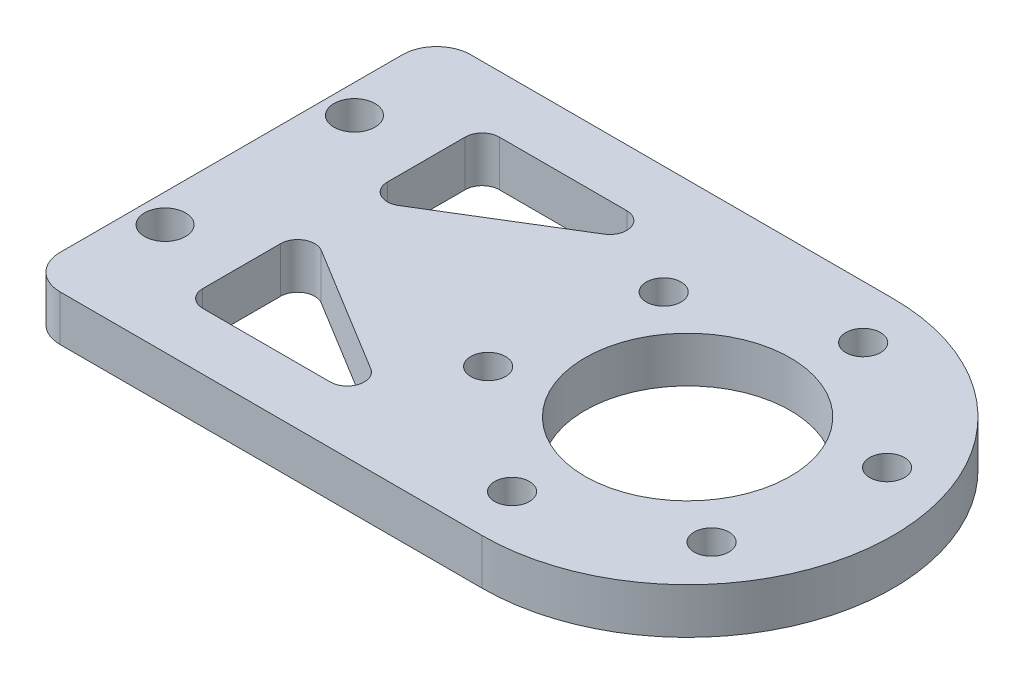
ISO-10303-21;
HEADER;
FILE_DESCRIPTION(('STEP AP214'),'2;1');
FILE_NAME('part.step','',(''),(''),'','','');
FILE_SCHEMA(('AUTOMOTIVE_DESIGN { 1 0 10303 214 1 1 1 1 }'));
ENDSEC;
DATA;
#1=APPLICATION_CONTEXT('core data for automotive mechanical design processes');
#2=APPLICATION_PROTOCOL_DEFINITION('international standard','automotive_design',2000,#1);
#3=PRODUCT_CONTEXT('',#1,'mechanical');
#4=PRODUCT('Part','Part','',(#3));
#5=PRODUCT_RELATED_PRODUCT_CATEGORY('part','',(#4));
#6=PRODUCT_DEFINITION_FORMATION('','',#4);
#7=PRODUCT_DEFINITION_CONTEXT('part definition',#1,'design');
#8=PRODUCT_DEFINITION('design','',#6,#7);
#9=PRODUCT_DEFINITION_SHAPE('','',#8);
#10=(LENGTH_UNIT() NAMED_UNIT(*) SI_UNIT(.MILLI.,.METRE.));
#11=(NAMED_UNIT(*) PLANE_ANGLE_UNIT() SI_UNIT($,.RADIAN.));
#12=(NAMED_UNIT(*) SI_UNIT($,.STERADIAN.) SOLID_ANGLE_UNIT());
#13=UNCERTAINTY_MEASURE_WITH_UNIT(LENGTH_MEASURE(1.E-05),#10,'distance_accuracy_value','');
#14=(GEOMETRIC_REPRESENTATION_CONTEXT(3) GLOBAL_UNCERTAINTY_ASSIGNED_CONTEXT((#13)) GLOBAL_UNIT_ASSIGNED_CONTEXT((#10,
#11,#12)) REPRESENTATION_CONTEXT('',''));
#15=CARTESIAN_POINT('',(0.,0.,0.));
#16=DIRECTION('',(0.,0.,1.));
#17=DIRECTION('',(1.,0.,0.));
#18=AXIS2_PLACEMENT_3D('',#15,#16,#17);
#19=CARTESIAN_POINT('',(0.,4.,0.));
#20=DIRECTION('',(0.,1.,0.));
#21=DIRECTION('',(0.,0.,1.));
#22=AXIS2_PLACEMENT_3D('',#19,#20,#21);
#23=PLANE('',#22);
#24=CARTESIAN_POINT('',(20.,4.,0.));
#25=DIRECTION('',(0.,1.,0.));
#26=DIRECTION('',(0.,0.,1.));
#27=AXIS2_PLACEMENT_3D('',#24,#25,#26);
#28=CIRCLE('',#27,9.);
#29=CARTESIAN_POINT('',(20.,4.,9.));
#30=VERTEX_POINT('',#29);
#31=EDGE_CURVE('E647',#30,#30,#28,.T.);
#32=ORIENTED_EDGE('',*,*,#31,.F.);
#33=EDGE_LOOP('',(#32));
#34=FACE_BOUND('',#33,.T.);
#35=DIRECTION('',(0.,0.,1.));
#36=VECTOR('',#35,1.);
#37=CARTESIAN_POINT('',(-11.,4.,0.));
#38=LINE('',#37,#36);
#39=CARTESIAN_POINT('',(-11.,4.,4.67458525914408));
#40=VERTEX_POINT('',#39);
#41=CARTESIAN_POINT('',(-11.,4.,11.5));
#42=VERTEX_POINT('',#41);
#43=EDGE_CURVE('E264',#40,#42,#38,.T.);
#44=ORIENTED_EDGE('',*,*,#43,.F.);
#45=CARTESIAN_POINT('',(-9.50000000000001,4.,4.67458525914408));
#46=DIRECTION('',(0.,1.,0.));
#47=DIRECTION('',(0.,0.,1.));
#48=AXIS2_PLACEMENT_3D('',#45,#46,#47);
#49=CIRCLE('',#48,1.5);
#50=CARTESIAN_POINT('',(-8.71782498581905,4.,3.39466250866614));
#51=VERTEX_POINT('',#50);
#52=EDGE_CURVE('E258',#40,#51,#49,.F.);
#53=ORIENTED_EDGE('',*,*,#52,.T.);
#54=DIRECTION('',(0.853281833651959,0.,0.521450009453975));
#55=VECTOR('',#54,1.);
#56=CARTESIAN_POINT('',(-3.8808988764045,4.,6.35056179775281));
#57=LINE('',#56,#55);
#58=CARTESIAN_POINT('',(2.45103549921791,4.,10.2200772495221));
#59=VERTEX_POINT('',#58);
#60=EDGE_CURVE('E289',#51,#59,#57,.T.);
#61=ORIENTED_EDGE('',*,*,#60,.T.);
#62=CARTESIAN_POINT('',(1.66886048503695,4.,11.5));
#63=DIRECTION('',(0.,1.,0.));
#64=DIRECTION('',(0.,0.,1.));
#65=AXIS2_PLACEMENT_3D('',#62,#63,#64);
#66=CIRCLE('',#65,1.5);
#67=CARTESIAN_POINT('',(1.66886048503695,4.,13.));
#68=VERTEX_POINT('',#67);
#69=EDGE_CURVE('E254',#59,#68,#66,.F.);
#70=ORIENTED_EDGE('',*,*,#69,.T.);
#71=DIRECTION('',(1.,0.,0.));
#72=VECTOR('',#71,1.);
#73=CARTESIAN_POINT('',(0.,4.,13.));
#74=LINE('',#73,#72);
#75=CARTESIAN_POINT('',(-9.50000000000001,4.,13.));
#76=VERTEX_POINT('',#75);
#77=EDGE_CURVE('E266',#76,#68,#74,.T.);
#78=ORIENTED_EDGE('',*,*,#77,.F.);
#79=CARTESIAN_POINT('',(-9.50000000000001,4.,11.5));
#80=DIRECTION('',(0.,1.,0.));
#81=DIRECTION('',(0.,0.,1.));
#82=AXIS2_PLACEMENT_3D('',#79,#80,#81);
#83=CIRCLE('',#82,1.5);
#84=EDGE_CURVE('E46',#76,#42,#83,.F.);
#85=ORIENTED_EDGE('',*,*,#84,.T.);
#86=EDGE_LOOP('',(#44,#53,#61,#70,#78,#85));
#87=FACE_BOUND('',#86,.T.);
#88=CARTESIAN_POINT('',(-17.5000000000019,4.,8.30000000000051));
#89=DIRECTION('',(0.,1.,0.));
#90=DIRECTION('',(0.,0.,1.));
#91=AXIS2_PLACEMENT_3D('',#88,#89,#90);
#92=CIRCLE('',#91,1.80000000000241);
#93=CARTESIAN_POINT('',(-17.5000000000019,4.,10.1000000000029));
#94=VERTEX_POINT('',#93);
#95=EDGE_CURVE('E318',#94,#94,#92,.T.);
#96=ORIENTED_EDGE('',*,*,#95,.F.);
#97=EDGE_LOOP('',(#96));
#98=FACE_BOUND('',#97,.T.);
#99=CARTESIAN_POINT('',(-17.5000000000019,4.,-8.29999999999949));
#100=DIRECTION('',(0.,1.,0.));
#101=DIRECTION('',(0.,0.,1.));
#102=AXIS2_PLACEMENT_3D('',#99,#100,#101);
#103=CIRCLE('',#102,1.80000000000241);
#104=CARTESIAN_POINT('',(-17.5000000000019,4.,-6.49999999999708));
#105=VERTEX_POINT('',#104);
#106=EDGE_CURVE('E306',#105,#105,#103,.T.);
#107=ORIENTED_EDGE('',*,*,#106,.F.);
#108=EDGE_LOOP('',(#107));
#109=FACE_BOUND('',#108,.T.);
#110=CARTESIAN_POINT('',(22.0405474756566,4.,-13.3448928807837));
#111=DIRECTION('',(0.,1.,0.));
#112=DIRECTION('',(0.,0.,1.));
#113=AXIS2_PLACEMENT_3D('',#110,#111,#112);
#114=CIRCLE('',#113,1.525);
#115=CARTESIAN_POINT('',(22.0405474756566,4.,-11.8198928807837));
#116=VERTEX_POINT('',#115);
#117=EDGE_CURVE('E317',#116,#116,#114,.T.);
#118=ORIENTED_EDGE('',*,*,#117,.F.);
#119=EDGE_LOOP('',(#118));
#120=FACE_BOUND('',#119,.T.);
#121=CARTESIAN_POINT('',(7.42271001663097,4.,4.90528048884506));
#122=DIRECTION('',(0.,1.,0.));
#123=DIRECTION('',(0.,0.,1.));
#124=AXIS2_PLACEMENT_3D('',#121,#122,#123);
#125=CIRCLE('',#124,1.525);
#126=CARTESIAN_POINT('',(7.42271001663097,4.,6.43028048884506));
#127=VERTEX_POINT('',#126);
#128=EDGE_CURVE('E344',#127,#127,#125,.T.);
#129=ORIENTED_EDGE('',*,*,#128,.F.);
#130=EDGE_LOOP('',(#129));
#131=FACE_BOUND('',#130,.T.);
#132=CARTESIAN_POINT('',(30.5367425077125,4.,8.43961239193871));
#133=DIRECTION('',(0.,1.,0.));
#134=DIRECTION('',(0.,0.,1.));
#135=AXIS2_PLACEMENT_3D('',#132,#133,#134);
#136=CIRCLE('',#135,1.525);
#137=CARTESIAN_POINT('',(30.5367425077125,4.,9.96461239193871));
#138=VERTEX_POINT('',#137);
#139=EDGE_CURVE('E329',#138,#138,#136,.T.);
#140=ORIENTED_EDGE('',*,*,#139,.F.);
#141=EDGE_LOOP('',(#140));
#142=FACE_BOUND('',#141,.T.);
#143=CARTESIAN_POINT('',(17.9594525243435,4.,13.3448928807837));
#144=DIRECTION('',(0.,1.,0.));
#145=DIRECTION('',(0.,0.,1.));
#146=AXIS2_PLACEMENT_3D('',#143,#144,#145);
#147=CIRCLE('',#146,1.525);
#148=CARTESIAN_POINT('',(17.9594525243435,4.,14.8698928807837));
#149=VERTEX_POINT('',#148);
#150=EDGE_CURVE('E330',#149,#149,#147,.T.);
#151=ORIENTED_EDGE('',*,*,#150,.F.);
#152=EDGE_LOOP('',(#151));
#153=FACE_BOUND('',#152,.T.);
#154=CARTESIAN_POINT('',(32.5772899833691,4.,-4.90528048884498));
#155=DIRECTION('',(0.,1.,0.));
#156=DIRECTION('',(0.,0.,1.));
#157=AXIS2_PLACEMENT_3D('',#154,#155,#156);
#158=CIRCLE('',#157,1.525);
#159=CARTESIAN_POINT('',(32.5772899833691,4.,-3.38028048884499));
#160=VERTEX_POINT('',#159);
#161=EDGE_CURVE('E336',#160,#160,#158,.T.);
#162=ORIENTED_EDGE('',*,*,#161,.F.);
#163=EDGE_LOOP('',(#162));
#164=FACE_BOUND('',#163,.T.);
#165=CARTESIAN_POINT('',(9.46325749228757,4.,-8.43961239193863));
#166=DIRECTION('',(0.,1.,0.));
#167=DIRECTION('',(0.,0.,1.));
#168=AXIS2_PLACEMENT_3D('',#165,#166,#167);
#169=CIRCLE('',#168,1.525);
#170=CARTESIAN_POINT('',(9.46325749228757,4.,-6.91461239193864));
#171=VERTEX_POINT('',#170);
#172=EDGE_CURVE('E343',#171,#171,#169,.T.);
#173=ORIENTED_EDGE('',*,*,#172,.F.);
#174=EDGE_LOOP('',(#173));
#175=FACE_BOUND('',#174,.T.);
#176=DIRECTION('',(1.,0.,0.));
#177=VECTOR('',#176,1.);
#178=CARTESIAN_POINT('',(0.,4.,-18.));
#179=LINE('',#178,#177);
#180=CARTESIAN_POINT('',(-17.,4.,-18.));
#181=VERTEX_POINT('',#180);
#182=CARTESIAN_POINT('',(20.,4.,-18.));
#183=VERTEX_POINT('',#182);
#184=EDGE_CURVE('E186',#181,#183,#179,.T.);
#185=ORIENTED_EDGE('',*,*,#184,.F.);
#186=CARTESIAN_POINT('',(-17.,4.,-15.));
#187=DIRECTION('',(0.,1.,0.));
#188=DIRECTION('',(0.,0.,1.));
#189=AXIS2_PLACEMENT_3D('',#186,#187,#188);
#190=CIRCLE('',#189,3.);
#191=CARTESIAN_POINT('',(-20.,4.,-15.));
#192=VERTEX_POINT('',#191);
#193=EDGE_CURVE('E209',#181,#192,#190,.T.);
#194=ORIENTED_EDGE('',*,*,#193,.T.);
#195=DIRECTION('',(0.,0.,-1.));
#196=VECTOR('',#195,1.);
#197=CARTESIAN_POINT('',(-20.,4.,0.));
#198=LINE('',#197,#196);
#199=CARTESIAN_POINT('',(-20.,4.,15.));
#200=VERTEX_POINT('',#199);
#201=EDGE_CURVE('E196',#200,#192,#198,.T.);
#202=ORIENTED_EDGE('',*,*,#201,.F.);
#203=CARTESIAN_POINT('',(-17.,4.,15.));
#204=DIRECTION('',(0.,1.,0.));
#205=DIRECTION('',(0.,0.,1.));
#206=AXIS2_PLACEMENT_3D('',#203,#204,#205);
#207=CIRCLE('',#206,3.);
#208=CARTESIAN_POINT('',(-17.,4.,18.));
#209=VERTEX_POINT('',#208);
#210=EDGE_CURVE('E172',#200,#209,#207,.T.);
#211=ORIENTED_EDGE('',*,*,#210,.T.);
#212=DIRECTION('',(1.,0.,0.));
#213=VECTOR('',#212,1.);
#214=CARTESIAN_POINT('',(0.,4.,18.));
#215=LINE('',#214,#213);
#216=CARTESIAN_POINT('',(20.,4.,18.));
#217=VERTEX_POINT('',#216);
#218=EDGE_CURVE('E164',#209,#217,#215,.T.);
#219=ORIENTED_EDGE('',*,*,#218,.T.);
#220=CARTESIAN_POINT('',(20.,4.,0.));
#221=DIRECTION('',(0.,1.,0.));
#222=DIRECTION('',(0.,0.,1.));
#223=AXIS2_PLACEMENT_3D('',#220,#221,#222);
#224=CIRCLE('',#223,18.);
#225=EDGE_CURVE('E168',#217,#183,#224,.T.);
#226=ORIENTED_EDGE('',*,*,#225,.T.);
#227=EDGE_LOOP('',(#185,#194,#202,#211,#219,#226));
#228=FACE_BOUND('',#227,.T.);
#229=DIRECTION('',(0.853281833651959,0.,-0.521450009453975));
#230=VECTOR('',#229,1.);
#231=CARTESIAN_POINT('',(-3.8808988764045,4.,-6.35056179775281));
#232=LINE('',#231,#230);
#233=CARTESIAN_POINT('',(-8.71782498581904,4.,-3.39466250866614));
#234=VERTEX_POINT('',#233);
#235=CARTESIAN_POINT('',(2.45103549921791,4.,-10.2200772495221));
#236=VERTEX_POINT('',#235);
#237=EDGE_CURVE('E309',#234,#236,#232,.T.);
#238=ORIENTED_EDGE('',*,*,#237,.F.);
#239=CARTESIAN_POINT('',(-9.50000000000001,4.,-4.67458525914408));
#240=DIRECTION('',(0.,1.,0.));
#241=DIRECTION('',(0.,0.,1.));
#242=AXIS2_PLACEMENT_3D('',#239,#240,#241);
#243=CIRCLE('',#242,1.5);
#244=CARTESIAN_POINT('',(-11.,4.,-4.67458525914408));
#245=VERTEX_POINT('',#244);
#246=EDGE_CURVE('E232',#234,#245,#243,.F.);
#247=ORIENTED_EDGE('',*,*,#246,.T.);
#248=DIRECTION('',(0.,0.,-1.));
#249=VECTOR('',#248,1.);
#250=CARTESIAN_POINT('',(-11.,4.,0.));
#251=LINE('',#250,#249);
#252=CARTESIAN_POINT('',(-11.,4.,-11.5));
#253=VERTEX_POINT('',#252);
#254=EDGE_CURVE('E287',#245,#253,#251,.T.);
#255=ORIENTED_EDGE('',*,*,#254,.T.);
#256=CARTESIAN_POINT('',(-9.50000000000001,4.,-11.5));
#257=DIRECTION('',(0.,1.,0.));
#258=DIRECTION('',(0.,0.,1.));
#259=AXIS2_PLACEMENT_3D('',#256,#257,#258);
#260=CIRCLE('',#259,1.5);
#261=CARTESIAN_POINT('',(-9.50000000000001,4.,-13.));
#262=VERTEX_POINT('',#261);
#263=EDGE_CURVE('E236',#253,#262,#260,.F.);
#264=ORIENTED_EDGE('',*,*,#263,.T.);
#265=DIRECTION('',(1.,0.,0.));
#266=VECTOR('',#265,1.);
#267=CARTESIAN_POINT('',(0.,4.,-13.));
#268=LINE('',#267,#266);
#269=CARTESIAN_POINT('',(1.66886048503695,4.,-13.));
#270=VERTEX_POINT('',#269);
#271=EDGE_CURVE('E300',#262,#270,#268,.T.);
#272=ORIENTED_EDGE('',*,*,#271,.T.);
#273=CARTESIAN_POINT('',(1.66886048503695,4.,-11.5));
#274=DIRECTION('',(0.,1.,0.));
#275=DIRECTION('',(0.,0.,1.));
#276=AXIS2_PLACEMENT_3D('',#273,#274,#275);
#277=CIRCLE('',#276,1.5);
#278=EDGE_CURVE('E228',#270,#236,#277,.F.);
#279=ORIENTED_EDGE('',*,*,#278,.T.);
#280=EDGE_LOOP('',(#238,#247,#255,#264,#272,#279));
#281=FACE_BOUND('',#280,.T.);
#282=ADVANCED_FACE('F38',(#34,#87,#98,#109,#120,#131,#142,#153,#164,#175,#228,#281),#23,.T.);
#283=CARTESIAN_POINT('',(0.,0.,0.));
#284=DIRECTION('',(0.,1.,0.));
#285=DIRECTION('',(0.,0.,1.));
#286=AXIS2_PLACEMENT_3D('',#283,#284,#285);
#287=PLANE('',#286);
#288=CARTESIAN_POINT('',(20.,0.,0.));
#289=DIRECTION('',(0.,1.,0.));
#290=DIRECTION('',(0.,0.,1.));
#291=AXIS2_PLACEMENT_3D('',#288,#289,#290);
#292=CIRCLE('',#291,9.);
#293=CARTESIAN_POINT('',(20.,0.,9.));
#294=VERTEX_POINT('',#293);
#295=EDGE_CURVE('E271',#294,#294,#292,.T.);
#296=ORIENTED_EDGE('',*,*,#295,.T.);
#297=EDGE_LOOP('',(#296));
#298=FACE_BOUND('',#297,.T.);
#299=DIRECTION('',(0.853281833651959,0.,0.521450009453975));
#300=VECTOR('',#299,1.);
#301=CARTESIAN_POINT('',(-3.8808988764045,0.,6.35056179775281));
#302=LINE('',#301,#300);
#303=CARTESIAN_POINT('',(-8.71782498581905,0.,3.39466250866614));
#304=VERTEX_POINT('',#303);
#305=CARTESIAN_POINT('',(2.45103549921791,0.,10.2200772495221));
#306=VERTEX_POINT('',#305);
#307=EDGE_CURVE('E284',#304,#306,#302,.T.);
#308=ORIENTED_EDGE('',*,*,#307,.F.);
#309=CARTESIAN_POINT('',(-9.50000000000001,0.,4.67458525914408));
#310=DIRECTION('',(0.,1.,0.));
#311=DIRECTION('',(0.,0.,1.));
#312=AXIS2_PLACEMENT_3D('',#309,#310,#311);
#313=CIRCLE('',#312,1.5);
#314=CARTESIAN_POINT('',(-11.,0.,4.67458525914408));
#315=VERTEX_POINT('',#314);
#316=EDGE_CURVE('E60',#304,#315,#313,.T.);
#317=ORIENTED_EDGE('',*,*,#316,.T.);
#318=DIRECTION('',(0.,0.,1.));
#319=VECTOR('',#318,1.);
#320=CARTESIAN_POINT('',(-11.,0.,0.));
#321=LINE('',#320,#319);
#322=CARTESIAN_POINT('',(-11.,0.,11.5));
#323=VERTEX_POINT('',#322);
#324=EDGE_CURVE('E280',#315,#323,#321,.T.);
#325=ORIENTED_EDGE('',*,*,#324,.T.);
#326=CARTESIAN_POINT('',(-9.50000000000001,0.,11.5));
#327=DIRECTION('',(0.,1.,0.));
#328=DIRECTION('',(0.,0.,1.));
#329=AXIS2_PLACEMENT_3D('',#326,#327,#328);
#330=CIRCLE('',#329,1.5);
#331=CARTESIAN_POINT('',(-9.50000000000001,0.,13.));
#332=VERTEX_POINT('',#331);
#333=EDGE_CURVE('E11',#323,#332,#330,.T.);
#334=ORIENTED_EDGE('',*,*,#333,.T.);
#335=DIRECTION('',(1.,0.,0.));
#336=VECTOR('',#335,1.);
#337=CARTESIAN_POINT('',(0.,0.,13.));
#338=LINE('',#337,#336);
#339=CARTESIAN_POINT('',(1.66886048503695,0.,13.));
#340=VERTEX_POINT('',#339);
#341=EDGE_CURVE('E278',#332,#340,#338,.T.);
#342=ORIENTED_EDGE('',*,*,#341,.T.);
#343=CARTESIAN_POINT('',(1.66886048503695,0.,11.5));
#344=DIRECTION('',(0.,1.,0.));
#345=DIRECTION('',(0.,0.,1.));
#346=AXIS2_PLACEMENT_3D('',#343,#344,#345);
#347=CIRCLE('',#346,1.5);
#348=EDGE_CURVE('E256',#340,#306,#347,.T.);
#349=ORIENTED_EDGE('',*,*,#348,.T.);
#350=EDGE_LOOP('',(#308,#317,#325,#334,#342,#349));
#351=FACE_BOUND('',#350,.T.);
#352=DIRECTION('',(0.,0.,-1.));
#353=VECTOR('',#352,1.);
#354=CARTESIAN_POINT('',(-20.,0.,0.));
#355=LINE('',#354,#353);
#356=CARTESIAN_POINT('',(-20.,0.,15.));
#357=VERTEX_POINT('',#356);
#358=CARTESIAN_POINT('',(-20.,0.,-15.));
#359=VERTEX_POINT('',#358);
#360=EDGE_CURVE('E177',#357,#359,#355,.T.);
#361=ORIENTED_EDGE('',*,*,#360,.T.);
#362=CARTESIAN_POINT('',(-17.,0.,-15.));
#363=DIRECTION('',(0.,1.,0.));
#364=DIRECTION('',(0.,0.,1.));
#365=AXIS2_PLACEMENT_3D('',#362,#363,#364);
#366=CIRCLE('',#365,3.);
#367=CARTESIAN_POINT('',(-17.,0.,-18.));
#368=VERTEX_POINT('',#367);
#369=EDGE_CURVE('E204',#359,#368,#366,.F.);
#370=ORIENTED_EDGE('',*,*,#369,.T.);
#371=DIRECTION('',(1.,0.,0.));
#372=VECTOR('',#371,1.);
#373=CARTESIAN_POINT('',(0.,0.,-18.));
#374=LINE('',#373,#372);
#375=CARTESIAN_POINT('',(20.,0.,-18.));
#376=VERTEX_POINT('',#375);
#377=EDGE_CURVE('E367',#368,#376,#374,.T.);
#378=ORIENTED_EDGE('',*,*,#377,.T.);
#379=CARTESIAN_POINT('',(20.,0.,0.));
#380=DIRECTION('',(0.,1.,0.));
#381=DIRECTION('',(0.,0.,1.));
#382=AXIS2_PLACEMENT_3D('',#379,#380,#381);
#383=CIRCLE('',#382,18.);
#384=CARTESIAN_POINT('',(20.,0.,18.));
#385=VERTEX_POINT('',#384);
#386=EDGE_CURVE('E365',#385,#376,#383,.T.);
#387=ORIENTED_EDGE('',*,*,#386,.F.);
#388=DIRECTION('',(1.,0.,0.));
#389=VECTOR('',#388,1.);
#390=CARTESIAN_POINT('',(0.,0.,18.));
#391=LINE('',#390,#389);
#392=CARTESIAN_POINT('',(-17.,0.,18.));
#393=VERTEX_POINT('',#392);
#394=EDGE_CURVE('E190',#393,#385,#391,.T.);
#395=ORIENTED_EDGE('',*,*,#394,.F.);
#396=CARTESIAN_POINT('',(-17.,0.,15.));
#397=DIRECTION('',(0.,1.,0.));
#398=DIRECTION('',(0.,0.,1.));
#399=AXIS2_PLACEMENT_3D('',#396,#397,#398);
#400=CIRCLE('',#399,3.);
#401=EDGE_CURVE('E202',#393,#357,#400,.F.);
#402=ORIENTED_EDGE('',*,*,#401,.T.);
#403=EDGE_LOOP('',(#361,#370,#378,#387,#395,#402));
#404=FACE_BOUND('',#403,.T.);
#405=CARTESIAN_POINT('',(9.46325749228757,0.,-8.43961239193863));
#406=DIRECTION('',(0.,1.,0.));
#407=DIRECTION('',(0.,0.,1.));
#408=AXIS2_PLACEMENT_3D('',#405,#406,#407);
#409=CIRCLE('',#408,1.525);
#410=CARTESIAN_POINT('',(9.46325749228757,0.,-6.91461239193864));
#411=VERTEX_POINT('',#410);
#412=EDGE_CURVE('E356',#411,#411,#409,.T.);
#413=ORIENTED_EDGE('',*,*,#412,.T.);
#414=EDGE_LOOP('',(#413));
#415=FACE_BOUND('',#414,.T.);
#416=CARTESIAN_POINT('',(32.5772899833691,0.,-4.90528048884498));
#417=DIRECTION('',(0.,1.,0.));
#418=DIRECTION('',(0.,0.,1.));
#419=AXIS2_PLACEMENT_3D('',#416,#417,#418);
#420=CIRCLE('',#419,1.525);
#421=CARTESIAN_POINT('',(32.5772899833691,0.,-3.38028048884499));
#422=VERTEX_POINT('',#421);
#423=EDGE_CURVE('E333',#422,#422,#420,.T.);
#424=ORIENTED_EDGE('',*,*,#423,.T.);
#425=EDGE_LOOP('',(#424));
#426=FACE_BOUND('',#425,.T.);
#427=CARTESIAN_POINT('',(17.9594525243435,0.,13.3448928807837));
#428=DIRECTION('',(0.,1.,0.));
#429=DIRECTION('',(0.,0.,1.));
#430=AXIS2_PLACEMENT_3D('',#427,#428,#429);
#431=CIRCLE('',#430,1.525);
#432=CARTESIAN_POINT('',(17.9594525243435,0.,14.8698928807837));
#433=VERTEX_POINT('',#432);
#434=EDGE_CURVE('E326',#433,#433,#431,.T.);
#435=ORIENTED_EDGE('',*,*,#434,.T.);
#436=EDGE_LOOP('',(#435));
#437=FACE_BOUND('',#436,.T.);
#438=CARTESIAN_POINT('',(30.5367425077125,0.,8.43961239193871));
#439=DIRECTION('',(0.,1.,0.));
#440=DIRECTION('',(0.,0.,1.));
#441=AXIS2_PLACEMENT_3D('',#438,#439,#440);
#442=CIRCLE('',#441,1.525);
#443=CARTESIAN_POINT('',(30.5367425077125,0.,9.96461239193871));
#444=VERTEX_POINT('',#443);
#445=EDGE_CURVE('E347',#444,#444,#442,.T.);
#446=ORIENTED_EDGE('',*,*,#445,.T.);
#447=EDGE_LOOP('',(#446));
#448=FACE_BOUND('',#447,.T.);
#449=CARTESIAN_POINT('',(7.42271001663097,0.,4.90528048884506));
#450=DIRECTION('',(0.,1.,0.));
#451=DIRECTION('',(0.,0.,1.));
#452=AXIS2_PLACEMENT_3D('',#449,#450,#451);
#453=CIRCLE('',#452,1.525);
#454=CARTESIAN_POINT('',(7.42271001663097,0.,6.43028048884506));
#455=VERTEX_POINT('',#454);
#456=EDGE_CURVE('E340',#455,#455,#453,.T.);
#457=ORIENTED_EDGE('',*,*,#456,.T.);
#458=EDGE_LOOP('',(#457));
#459=FACE_BOUND('',#458,.T.);
#460=CARTESIAN_POINT('',(22.0405474756566,0.,-13.3448928807837));
#461=DIRECTION('',(0.,1.,0.));
#462=DIRECTION('',(0.,0.,1.));
#463=AXIS2_PLACEMENT_3D('',#460,#461,#462);
#464=CIRCLE('',#463,1.525);
#465=CARTESIAN_POINT('',(22.0405474756566,0.,-11.8198928807837));
#466=VERTEX_POINT('',#465);
#467=EDGE_CURVE('E339',#466,#466,#464,.T.);
#468=ORIENTED_EDGE('',*,*,#467,.T.);
#469=EDGE_LOOP('',(#468));
#470=FACE_BOUND('',#469,.T.);
#471=CARTESIAN_POINT('',(-17.5000000000019,0.,-8.29999999999949));
#472=DIRECTION('',(0.,1.,0.));
#473=DIRECTION('',(0.,0.,1.));
#474=AXIS2_PLACEMENT_3D('',#471,#472,#473);
#475=CIRCLE('',#474,1.80000000000241);
#476=CARTESIAN_POINT('',(-17.5000000000019,0.,-6.49999999999708));
#477=VERTEX_POINT('',#476);
#478=EDGE_CURVE('E321',#477,#477,#475,.T.);
#479=ORIENTED_EDGE('',*,*,#478,.T.);
#480=EDGE_LOOP('',(#479));
#481=FACE_BOUND('',#480,.T.);
#482=CARTESIAN_POINT('',(-17.5000000000019,0.,8.30000000000051));
#483=DIRECTION('',(0.,1.,0.));
#484=DIRECTION('',(0.,0.,1.));
#485=AXIS2_PLACEMENT_3D('',#482,#483,#484);
#486=CIRCLE('',#485,1.80000000000241);
#487=CARTESIAN_POINT('',(-17.5000000000019,0.,10.1000000000029));
#488=VERTEX_POINT('',#487);
#489=EDGE_CURVE('E314',#488,#488,#486,.T.);
#490=ORIENTED_EDGE('',*,*,#489,.T.);
#491=EDGE_LOOP('',(#490));
#492=FACE_BOUND('',#491,.T.);
#493=DIRECTION('',(0.,0.,-1.));
#494=VECTOR('',#493,1.);
#495=CARTESIAN_POINT('',(-11.,0.,0.));
#496=LINE('',#495,#494);
#497=CARTESIAN_POINT('',(-11.,0.,-4.67458525914408));
#498=VERTEX_POINT('',#497);
#499=CARTESIAN_POINT('',(-11.,0.,-11.5));
#500=VERTEX_POINT('',#499);
#501=EDGE_CURVE('E296',#498,#500,#496,.T.);
#502=ORIENTED_EDGE('',*,*,#501,.F.);
#503=CARTESIAN_POINT('',(-9.50000000000001,0.,-4.67458525914408));
#504=DIRECTION('',(0.,1.,0.));
#505=DIRECTION('',(0.,0.,1.));
#506=AXIS2_PLACEMENT_3D('',#503,#504,#505);
#507=CIRCLE('',#506,1.5);
#508=CARTESIAN_POINT('',(-8.71782498581904,0.,-3.39466250866614));
#509=VERTEX_POINT('',#508);
#510=EDGE_CURVE('E234',#498,#509,#507,.T.);
#511=ORIENTED_EDGE('',*,*,#510,.T.);
#512=DIRECTION('',(0.853281833651959,0.,-0.521450009453975));
#513=VECTOR('',#512,1.);
#514=CARTESIAN_POINT('',(-3.8808988764045,0.,-6.35056179775281));
#515=LINE('',#514,#513);
#516=CARTESIAN_POINT('',(2.45103549921791,0.,-10.2200772495221));
#517=VERTEX_POINT('',#516);
#518=EDGE_CURVE('E299',#509,#517,#515,.T.);
#519=ORIENTED_EDGE('',*,*,#518,.T.);
#520=CARTESIAN_POINT('',(1.66886048503695,0.,-11.5));
#521=DIRECTION('',(0.,1.,0.));
#522=DIRECTION('',(0.,0.,1.));
#523=AXIS2_PLACEMENT_3D('',#520,#521,#522);
#524=CIRCLE('',#523,1.5);
#525=CARTESIAN_POINT('',(1.66886048503695,0.,-13.));
#526=VERTEX_POINT('',#525);
#527=EDGE_CURVE('E230',#517,#526,#524,.T.);
#528=ORIENTED_EDGE('',*,*,#527,.T.);
#529=DIRECTION('',(1.,0.,0.));
#530=VECTOR('',#529,1.);
#531=CARTESIAN_POINT('',(0.,0.,-13.));
#532=LINE('',#531,#530);
#533=CARTESIAN_POINT('',(-9.50000000000001,0.,-13.));
#534=VERTEX_POINT('',#533);
#535=EDGE_CURVE('E303',#534,#526,#532,.T.);
#536=ORIENTED_EDGE('',*,*,#535,.F.);
#537=CARTESIAN_POINT('',(-9.50000000000001,0.,-11.5));
#538=DIRECTION('',(0.,1.,0.));
#539=DIRECTION('',(0.,0.,1.));
#540=AXIS2_PLACEMENT_3D('',#537,#538,#539);
#541=CIRCLE('',#540,1.5);
#542=EDGE_CURVE('E238',#534,#500,#541,.T.);
#543=ORIENTED_EDGE('',*,*,#542,.T.);
#544=EDGE_LOOP('',(#502,#511,#519,#528,#536,#543));
#545=FACE_BOUND('',#544,.T.);
#546=ADVANCED_FACE('F276',(#298,#351,#404,#415,#426,#437,#448,#459,#470,#481,#492,#545),#287,.F.);
#547=CARTESIAN_POINT('',(0.,4.,18.));
#548=DIRECTION('',(0.,0.,-1.));
#549=DIRECTION('',(-1.,0.,0.));
#550=AXIS2_PLACEMENT_3D('',#547,#548,#549);
#551=PLANE('',#550);
#552=ORIENTED_EDGE('',*,*,#218,.F.);
#553=DIRECTION('',(0.,-1.,0.));
#554=VECTOR('',#553,1.);
#555=CARTESIAN_POINT('',(-17.,0.,18.));
#556=LINE('',#555,#554);
#557=EDGE_CURVE('E211',#209,#393,#556,.T.);
#558=ORIENTED_EDGE('',*,*,#557,.T.);
#559=ORIENTED_EDGE('',*,*,#394,.T.);
#560=DIRECTION('',(0.,-1.,0.));
#561=VECTOR('',#560,1.);
#562=CARTESIAN_POINT('',(20.,4.,18.));
#563=LINE('',#562,#561);
#564=EDGE_CURVE('E183',#217,#385,#563,.T.);
#565=ORIENTED_EDGE('',*,*,#564,.F.);
#566=EDGE_LOOP('',(#552,#558,#559,#565));
#567=FACE_BOUND('',#566,.T.);
#568=ADVANCED_FACE('F188',(#567),#551,.F.);
#569=CARTESIAN_POINT('',(20.,4.,0.));
#570=DIRECTION('',(0.,-1.,0.));
#571=DIRECTION('',(0.,0.,-1.));
#572=AXIS2_PLACEMENT_3D('',#569,#570,#571);
#573=CYLINDRICAL_SURFACE('',#572,18.);
#574=ORIENTED_EDGE('',*,*,#386,.T.);
#575=DIRECTION('',(0.,-1.,0.));
#576=VECTOR('',#575,1.);
#577=CARTESIAN_POINT('',(20.,4.,-18.));
#578=LINE('',#577,#576);
#579=EDGE_CURVE('E185',#183,#376,#578,.T.);
#580=ORIENTED_EDGE('',*,*,#579,.F.);
#581=ORIENTED_EDGE('',*,*,#225,.F.);
#582=ORIENTED_EDGE('',*,*,#564,.T.);
#583=EDGE_LOOP('',(#574,#580,#581,#582));
#584=FACE_BOUND('',#583,.T.);
#585=ADVANCED_FACE('F182',(#584),#573,.T.);
#586=CARTESIAN_POINT('',(0.,4.,-18.));
#587=DIRECTION('',(0.,0.,-1.));
#588=DIRECTION('',(-1.,0.,0.));
#589=AXIS2_PLACEMENT_3D('',#586,#587,#588);
#590=PLANE('',#589);
#591=ORIENTED_EDGE('',*,*,#377,.F.);
#592=DIRECTION('',(0.,-1.,0.));
#593=VECTOR('',#592,1.);
#594=CARTESIAN_POINT('',(-17.,4.,-18.));
#595=LINE('',#594,#593);
#596=EDGE_CURVE('E206',#368,#181,#595,.F.);
#597=ORIENTED_EDGE('',*,*,#596,.T.);
#598=ORIENTED_EDGE('',*,*,#184,.T.);
#599=ORIENTED_EDGE('',*,*,#579,.T.);
#600=EDGE_LOOP('',(#591,#597,#598,#599));
#601=FACE_BOUND('',#600,.T.);
#602=ADVANCED_FACE('F380',(#601),#590,.T.);
#603=CARTESIAN_POINT('',(-20.,4.,0.));
#604=DIRECTION('',(-1.,0.,0.));
#605=DIRECTION('',(0.,0.,1.));
#606=AXIS2_PLACEMENT_3D('',#603,#604,#605);
#607=PLANE('',#606);
#608=ORIENTED_EDGE('',*,*,#201,.T.);
#609=DIRECTION('',(0.,-1.,0.));
#610=VECTOR('',#609,1.);
#611=CARTESIAN_POINT('',(-20.,4.,-15.));
#612=LINE('',#611,#610);
#613=EDGE_CURVE('E194',#192,#359,#612,.T.);
#614=ORIENTED_EDGE('',*,*,#613,.T.);
#615=ORIENTED_EDGE('',*,*,#360,.F.);
#616=DIRECTION('',(0.,-1.,0.));
#617=VECTOR('',#616,1.);
#618=CARTESIAN_POINT('',(-20.,4.,15.));
#619=LINE('',#618,#617);
#620=EDGE_CURVE('E192',#357,#200,#619,.F.);
#621=ORIENTED_EDGE('',*,*,#620,.T.);
#622=EDGE_LOOP('',(#608,#614,#615,#621));
#623=FACE_BOUND('',#622,.T.);
#624=ADVANCED_FACE('F374',(#623),#607,.T.);
#625=CARTESIAN_POINT('',(9.46325749228757,0.,-8.43961239193863));
#626=DIRECTION('',(0.,1.,0.));
#627=DIRECTION('',(0.,0.,1.));
#628=AXIS2_PLACEMENT_3D('',#625,#626,#627);
#629=CYLINDRICAL_SURFACE('',#628,1.525);
#630=ORIENTED_EDGE('',*,*,#412,.F.);
#631=EDGE_LOOP('',(#630));
#632=FACE_BOUND('',#631,.T.);
#633=ORIENTED_EDGE('',*,*,#172,.T.);
#634=EDGE_LOOP('',(#633));
#635=FACE_BOUND('',#634,.T.);
#636=ADVANCED_FACE('F407',(#632,#635),#629,.F.);
#637=CARTESIAN_POINT('',(32.5772899833691,0.,-4.90528048884498));
#638=DIRECTION('',(0.,1.,0.));
#639=DIRECTION('',(0.,0.,1.));
#640=AXIS2_PLACEMENT_3D('',#637,#638,#639);
#641=CYLINDRICAL_SURFACE('',#640,1.525);
#642=ORIENTED_EDGE('',*,*,#423,.F.);
#643=EDGE_LOOP('',(#642));
#644=FACE_BOUND('',#643,.T.);
#645=ORIENTED_EDGE('',*,*,#161,.T.);
#646=EDGE_LOOP('',(#645));
#647=FACE_BOUND('',#646,.T.);
#648=ADVANCED_FACE('F438',(#644,#647),#641,.F.);
#649=CARTESIAN_POINT('',(17.9594525243435,0.,13.3448928807837));
#650=DIRECTION('',(0.,1.,0.));
#651=DIRECTION('',(0.,0.,1.));
#652=AXIS2_PLACEMENT_3D('',#649,#650,#651);
#653=CYLINDRICAL_SURFACE('',#652,1.525);
#654=ORIENTED_EDGE('',*,*,#434,.F.);
#655=EDGE_LOOP('',(#654));
#656=FACE_BOUND('',#655,.T.);
#657=ORIENTED_EDGE('',*,*,#150,.T.);
#658=EDGE_LOOP('',(#657));
#659=FACE_BOUND('',#658,.T.);
#660=ADVANCED_FACE('F445',(#656,#659),#653,.F.);
#661=CARTESIAN_POINT('',(30.5367425077125,0.,8.43961239193871));
#662=DIRECTION('',(0.,1.,0.));
#663=DIRECTION('',(0.,0.,1.));
#664=AXIS2_PLACEMENT_3D('',#661,#662,#663);
#665=CYLINDRICAL_SURFACE('',#664,1.525);
#666=ORIENTED_EDGE('',*,*,#445,.F.);
#667=EDGE_LOOP('',(#666));
#668=FACE_BOUND('',#667,.T.);
#669=ORIENTED_EDGE('',*,*,#139,.T.);
#670=EDGE_LOOP('',(#669));
#671=FACE_BOUND('',#670,.T.);
#672=ADVANCED_FACE('F453',(#668,#671),#665,.F.);
#673=CARTESIAN_POINT('',(7.42271001663097,0.,4.90528048884506));
#674=DIRECTION('',(0.,1.,0.));
#675=DIRECTION('',(0.,0.,1.));
#676=AXIS2_PLACEMENT_3D('',#673,#674,#675);
#677=CYLINDRICAL_SURFACE('',#676,1.525);
#678=ORIENTED_EDGE('',*,*,#456,.F.);
#679=EDGE_LOOP('',(#678));
#680=FACE_BOUND('',#679,.T.);
#681=ORIENTED_EDGE('',*,*,#128,.T.);
#682=EDGE_LOOP('',(#681));
#683=FACE_BOUND('',#682,.T.);
#684=ADVANCED_FACE('F393',(#680,#683),#677,.F.);
#685=CARTESIAN_POINT('',(22.0405474756566,0.,-13.3448928807837));
#686=DIRECTION('',(0.,1.,0.));
#687=DIRECTION('',(0.,0.,1.));
#688=AXIS2_PLACEMENT_3D('',#685,#686,#687);
#689=CYLINDRICAL_SURFACE('',#688,1.525);
#690=ORIENTED_EDGE('',*,*,#467,.F.);
#691=EDGE_LOOP('',(#690));
#692=FACE_BOUND('',#691,.T.);
#693=ORIENTED_EDGE('',*,*,#117,.T.);
#694=EDGE_LOOP('',(#693));
#695=FACE_BOUND('',#694,.T.);
#696=ADVANCED_FACE('F385',(#692,#695),#689,.F.);
#697=CARTESIAN_POINT('',(-17.,4.,-15.));
#698=DIRECTION('',(0.,-1.,0.));
#699=DIRECTION('',(0.,0.,-1.));
#700=AXIS2_PLACEMENT_3D('',#697,#698,#699);
#701=CYLINDRICAL_SURFACE('',#700,3.);
#702=ORIENTED_EDGE('',*,*,#193,.F.);
#703=ORIENTED_EDGE('',*,*,#596,.F.);
#704=ORIENTED_EDGE('',*,*,#369,.F.);
#705=ORIENTED_EDGE('',*,*,#613,.F.);
#706=EDGE_LOOP('',(#702,#703,#704,#705));
#707=FACE_BOUND('',#706,.T.);
#708=ADVANCED_FACE('F383',(#707),#701,.T.);
#709=CARTESIAN_POINT('',(-17.,4.,15.));
#710=DIRECTION('',(0.,1.,0.));
#711=DIRECTION('',(0.,0.,1.));
#712=AXIS2_PLACEMENT_3D('',#709,#710,#711);
#713=CYLINDRICAL_SURFACE('',#712,3.);
#714=ORIENTED_EDGE('',*,*,#210,.F.);
#715=ORIENTED_EDGE('',*,*,#620,.F.);
#716=ORIENTED_EDGE('',*,*,#401,.F.);
#717=ORIENTED_EDGE('',*,*,#557,.F.);
#718=EDGE_LOOP('',(#714,#715,#716,#717));
#719=FACE_BOUND('',#718,.T.);
#720=ADVANCED_FACE('F377',(#719),#713,.T.);
#721=CARTESIAN_POINT('',(-17.5000000000019,0.,-8.29999999999949));
#722=DIRECTION('',(0.,1.,0.));
#723=DIRECTION('',(0.,0.,1.));
#724=AXIS2_PLACEMENT_3D('',#721,#722,#723);
#725=CYLINDRICAL_SURFACE('',#724,1.80000000000241);
#726=ORIENTED_EDGE('',*,*,#478,.F.);
#727=EDGE_LOOP('',(#726));
#728=FACE_BOUND('',#727,.T.);
#729=ORIENTED_EDGE('',*,*,#106,.T.);
#730=EDGE_LOOP('',(#729));
#731=FACE_BOUND('',#730,.T.);
#732=ADVANCED_FACE('F391',(#728,#731),#725,.F.);
#733=CARTESIAN_POINT('',(-17.5000000000019,0.,8.30000000000051));
#734=DIRECTION('',(0.,1.,0.));
#735=DIRECTION('',(0.,0.,1.));
#736=AXIS2_PLACEMENT_3D('',#733,#734,#735);
#737=CYLINDRICAL_SURFACE('',#736,1.80000000000241);
#738=ORIENTED_EDGE('',*,*,#489,.F.);
#739=EDGE_LOOP('',(#738));
#740=FACE_BOUND('',#739,.T.);
#741=ORIENTED_EDGE('',*,*,#95,.T.);
#742=EDGE_LOOP('',(#741));
#743=FACE_BOUND('',#742,.T.);
#744=ADVANCED_FACE('F493',(#740,#743),#737,.F.);
#745=CARTESIAN_POINT('',(-11.,0.,0.));
#746=DIRECTION('',(1.,0.,0.));
#747=DIRECTION('',(0.,0.,-1.));
#748=AXIS2_PLACEMENT_3D('',#745,#746,#747);
#749=PLANE('',#748);
#750=ORIENTED_EDGE('',*,*,#254,.F.);
#751=DIRECTION('',(0.,1.,0.));
#752=VECTOR('',#751,1.);
#753=CARTESIAN_POINT('',(-11.,0.,-4.67458525914408));
#754=LINE('',#753,#752);
#755=EDGE_CURVE('E226',#245,#498,#754,.F.);
#756=ORIENTED_EDGE('',*,*,#755,.T.);
#757=ORIENTED_EDGE('',*,*,#501,.T.);
#758=DIRECTION('',(0.,1.,0.));
#759=VECTOR('',#758,1.);
#760=CARTESIAN_POINT('',(-11.,4.,-11.5));
#761=LINE('',#760,#759);
#762=EDGE_CURVE('E223',#500,#253,#761,.T.);
#763=ORIENTED_EDGE('',*,*,#762,.T.);
#764=EDGE_LOOP('',(#750,#756,#757,#763));
#765=FACE_BOUND('',#764,.T.);
#766=ADVANCED_FACE('F502',(#765),#749,.T.);
#767=CARTESIAN_POINT('',(0.,0.,-13.));
#768=DIRECTION('',(0.,0.,1.));
#769=DIRECTION('',(1.,0.,0.));
#770=AXIS2_PLACEMENT_3D('',#767,#768,#769);
#771=PLANE('',#770);
#772=ORIENTED_EDGE('',*,*,#535,.T.);
#773=DIRECTION('',(0.,1.,0.));
#774=VECTOR('',#773,1.);
#775=CARTESIAN_POINT('',(1.66886048503695,0.,-13.));
#776=LINE('',#775,#774);
#777=EDGE_CURVE('E215',#526,#270,#776,.T.);
#778=ORIENTED_EDGE('',*,*,#777,.T.);
#779=ORIENTED_EDGE('',*,*,#271,.F.);
#780=DIRECTION('',(0.,1.,0.));
#781=VECTOR('',#780,1.);
#782=CARTESIAN_POINT('',(-9.50000000000001,0.,-13.));
#783=LINE('',#782,#781);
#784=EDGE_CURVE('E213',#262,#534,#783,.F.);
#785=ORIENTED_EDGE('',*,*,#784,.T.);
#786=EDGE_LOOP('',(#772,#778,#779,#785));
#787=FACE_BOUND('',#786,.T.);
#788=ADVANCED_FACE('F527',(#787),#771,.T.);
#789=CARTESIAN_POINT('',(-3.8808988764045,0.,-6.35056179775281));
#790=DIRECTION('',(0.521450009453975,0.,0.853281833651959));
#791=DIRECTION('',(0.853281833651959,0.,-0.521450009453975));
#792=AXIS2_PLACEMENT_3D('',#789,#790,#791);
#793=PLANE('',#792);
#794=ORIENTED_EDGE('',*,*,#237,.T.);
#795=DIRECTION('',(0.,1.,0.));
#796=VECTOR('',#795,1.);
#797=CARTESIAN_POINT('',(2.45103549921791,0.,-10.2200772495221));
#798=LINE('',#797,#796);
#799=EDGE_CURVE('E221',#236,#517,#798,.F.);
#800=ORIENTED_EDGE('',*,*,#799,.T.);
#801=ORIENTED_EDGE('',*,*,#518,.F.);
#802=DIRECTION('',(0.,1.,0.));
#803=VECTOR('',#802,1.);
#804=CARTESIAN_POINT('',(-8.71782498581904,0.,-3.39466250866614));
#805=LINE('',#804,#803);
#806=EDGE_CURVE('E218',#509,#234,#805,.T.);
#807=ORIENTED_EDGE('',*,*,#806,.T.);
#808=EDGE_LOOP('',(#794,#800,#801,#807));
#809=FACE_BOUND('',#808,.T.);
#810=ADVANCED_FACE('F536',(#809),#793,.F.);
#811=CARTESIAN_POINT('',(1.66886048503695,0.,-11.5));
#812=DIRECTION('',(0.,1.,0.));
#813=DIRECTION('',(0.,0.,1.));
#814=AXIS2_PLACEMENT_3D('',#811,#812,#813);
#815=CYLINDRICAL_SURFACE('',#814,1.5);
#816=ORIENTED_EDGE('',*,*,#527,.F.);
#817=ORIENTED_EDGE('',*,*,#799,.F.);
#818=ORIENTED_EDGE('',*,*,#278,.F.);
#819=ORIENTED_EDGE('',*,*,#777,.F.);
#820=EDGE_LOOP('',(#816,#817,#818,#819));
#821=FACE_BOUND('',#820,.T.);
#822=ADVANCED_FACE('F545',(#821),#815,.F.);
#823=CARTESIAN_POINT('',(-9.50000000000001,0.,-4.67458525914408));
#824=DIRECTION('',(0.,1.,0.));
#825=DIRECTION('',(0.,0.,1.));
#826=AXIS2_PLACEMENT_3D('',#823,#824,#825);
#827=CYLINDRICAL_SURFACE('',#826,1.5);
#828=ORIENTED_EDGE('',*,*,#510,.F.);
#829=ORIENTED_EDGE('',*,*,#755,.F.);
#830=ORIENTED_EDGE('',*,*,#246,.F.);
#831=ORIENTED_EDGE('',*,*,#806,.F.);
#832=EDGE_LOOP('',(#828,#829,#830,#831));
#833=FACE_BOUND('',#832,.T.);
#834=ADVANCED_FACE('F554',(#833),#827,.F.);
#835=CARTESIAN_POINT('',(-9.50000000000001,0.,-11.5));
#836=DIRECTION('',(0.,-1.,0.));
#837=DIRECTION('',(0.,0.,-1.));
#838=AXIS2_PLACEMENT_3D('',#835,#836,#837);
#839=CYLINDRICAL_SURFACE('',#838,1.5);
#840=ORIENTED_EDGE('',*,*,#542,.F.);
#841=ORIENTED_EDGE('',*,*,#784,.F.);
#842=ORIENTED_EDGE('',*,*,#263,.F.);
#843=ORIENTED_EDGE('',*,*,#762,.F.);
#844=EDGE_LOOP('',(#840,#841,#842,#843));
#845=FACE_BOUND('',#844,.T.);
#846=ADVANCED_FACE('F563',(#845),#839,.F.);
#847=CARTESIAN_POINT('',(-11.,0.,0.));
#848=DIRECTION('',(-1.,0.,0.));
#849=DIRECTION('',(0.,0.,1.));
#850=AXIS2_PLACEMENT_3D('',#847,#848,#849);
#851=PLANE('',#850);
#852=ORIENTED_EDGE('',*,*,#324,.F.);
#853=DIRECTION('',(0.,1.,0.));
#854=VECTOR('',#853,1.);
#855=CARTESIAN_POINT('',(-11.,0.,4.67458525914408));
#856=LINE('',#855,#854);
#857=EDGE_CURVE('E251',#315,#40,#856,.T.);
#858=ORIENTED_EDGE('',*,*,#857,.T.);
#859=ORIENTED_EDGE('',*,*,#43,.T.);
#860=DIRECTION('',(0.,1.,0.));
#861=VECTOR('',#860,1.);
#862=CARTESIAN_POINT('',(-11.,0.,11.5));
#863=LINE('',#862,#861);
#864=EDGE_CURVE('E53',#42,#323,#863,.F.);
#865=ORIENTED_EDGE('',*,*,#864,.T.);
#866=EDGE_LOOP('',(#852,#858,#859,#865));
#867=FACE_BOUND('',#866,.T.);
#868=ADVANCED_FACE('F269',(#867),#851,.F.);
#869=CARTESIAN_POINT('',(-3.8808988764045,0.,6.35056179775281));
#870=DIRECTION('',(-0.521450009453975,0.,0.853281833651959));
#871=DIRECTION('',(0.853281833651959,0.,0.521450009453975));
#872=AXIS2_PLACEMENT_3D('',#869,#870,#871);
#873=PLANE('',#872);
#874=ORIENTED_EDGE('',*,*,#307,.T.);
#875=DIRECTION('',(0.,1.,0.));
#876=VECTOR('',#875,1.);
#877=CARTESIAN_POINT('',(2.45103549921791,0.,10.2200772495221));
#878=LINE('',#877,#876);
#879=EDGE_CURVE('E242',#306,#59,#878,.T.);
#880=ORIENTED_EDGE('',*,*,#879,.T.);
#881=ORIENTED_EDGE('',*,*,#60,.F.);
#882=DIRECTION('',(0.,1.,0.));
#883=VECTOR('',#882,1.);
#884=CARTESIAN_POINT('',(-8.71782498581905,0.,3.39466250866614));
#885=LINE('',#884,#883);
#886=EDGE_CURVE('E240',#51,#304,#885,.F.);
#887=ORIENTED_EDGE('',*,*,#886,.T.);
#888=EDGE_LOOP('',(#874,#880,#881,#887));
#889=FACE_BOUND('',#888,.T.);
#890=ADVANCED_FACE('F580',(#889),#873,.T.);
#891=CARTESIAN_POINT('',(0.,0.,13.));
#892=DIRECTION('',(0.,0.,1.));
#893=DIRECTION('',(1.,0.,0.));
#894=AXIS2_PLACEMENT_3D('',#891,#892,#893);
#895=PLANE('',#894);
#896=ORIENTED_EDGE('',*,*,#77,.T.);
#897=DIRECTION('',(0.,1.,0.));
#898=VECTOR('',#897,1.);
#899=CARTESIAN_POINT('',(1.66886048503695,0.,13.));
#900=LINE('',#899,#898);
#901=EDGE_CURVE('E248',#68,#340,#900,.F.);
#902=ORIENTED_EDGE('',*,*,#901,.T.);
#903=ORIENTED_EDGE('',*,*,#341,.F.);
#904=DIRECTION('',(0.,1.,0.));
#905=VECTOR('',#904,1.);
#906=CARTESIAN_POINT('',(-9.50000000000001,4.,13.));
#907=LINE('',#906,#905);
#908=EDGE_CURVE('E245',#332,#76,#907,.T.);
#909=ORIENTED_EDGE('',*,*,#908,.T.);
#910=EDGE_LOOP('',(#896,#902,#903,#909));
#911=FACE_BOUND('',#910,.T.);
#912=ADVANCED_FACE('F282',(#911),#895,.F.);
#913=CARTESIAN_POINT('',(1.66886048503695,0.,11.5));
#914=DIRECTION('',(0.,1.,0.));
#915=DIRECTION('',(0.,0.,1.));
#916=AXIS2_PLACEMENT_3D('',#913,#914,#915);
#917=CYLINDRICAL_SURFACE('',#916,1.5);
#918=ORIENTED_EDGE('',*,*,#348,.F.);
#919=ORIENTED_EDGE('',*,*,#901,.F.);
#920=ORIENTED_EDGE('',*,*,#69,.F.);
#921=ORIENTED_EDGE('',*,*,#879,.F.);
#922=EDGE_LOOP('',(#918,#919,#920,#921));
#923=FACE_BOUND('',#922,.T.);
#924=ADVANCED_FACE('F596',(#923),#917,.F.);
#925=CARTESIAN_POINT('',(-9.50000000000001,0.,4.67458525914408));
#926=DIRECTION('',(0.,1.,0.));
#927=DIRECTION('',(0.,0.,1.));
#928=AXIS2_PLACEMENT_3D('',#925,#926,#927);
#929=CYLINDRICAL_SURFACE('',#928,1.5);
#930=ORIENTED_EDGE('',*,*,#316,.F.);
#931=ORIENTED_EDGE('',*,*,#886,.F.);
#932=ORIENTED_EDGE('',*,*,#52,.F.);
#933=ORIENTED_EDGE('',*,*,#857,.F.);
#934=EDGE_LOOP('',(#930,#931,#932,#933));
#935=FACE_BOUND('',#934,.T.);
#936=ADVANCED_FACE('F604',(#935),#929,.F.);
#937=CARTESIAN_POINT('',(-9.50000000000001,0.,11.5));
#938=DIRECTION('',(0.,-1.,0.));
#939=DIRECTION('',(0.,0.,-1.));
#940=AXIS2_PLACEMENT_3D('',#937,#938,#939);
#941=CYLINDRICAL_SURFACE('',#940,1.5);
#942=ORIENTED_EDGE('',*,*,#333,.F.);
#943=ORIENTED_EDGE('',*,*,#864,.F.);
#944=ORIENTED_EDGE('',*,*,#84,.F.);
#945=ORIENTED_EDGE('',*,*,#908,.F.);
#946=EDGE_LOOP('',(#942,#943,#944,#945));
#947=FACE_BOUND('',#946,.T.);
#948=ADVANCED_FACE('F40',(#947),#941,.F.);
#949=CARTESIAN_POINT('',(20.,0.,0.));
#950=DIRECTION('',(0.,1.,0.));
#951=DIRECTION('',(0.,0.,1.));
#952=AXIS2_PLACEMENT_3D('',#949,#950,#951);
#953=CYLINDRICAL_SURFACE('',#952,9.);
#954=ORIENTED_EDGE('',*,*,#295,.F.);
#955=EDGE_LOOP('',(#954));
#956=FACE_BOUND('',#955,.T.);
#957=ORIENTED_EDGE('',*,*,#31,.T.);
#958=EDGE_LOOP('',(#957));
#959=FACE_BOUND('',#958,.T.);
#960=ADVANCED_FACE('F619',(#956,#959),#953,.F.);
#961=CLOSED_SHELL('',(#282,#546,#568,#585,#602,#624,#636,#648,#660,#672,#684,#696,#708,#720,
#732,#744,#766,#788,#810,#822,#834,#846,#868,#890,#912,#924,#936,#948,#960));
#962=MANIFOLD_SOLID_BREP('B2',#961);
#963=ADVANCED_BREP_SHAPE_REPRESENTATION('',(#18,#962),#14);
#964=SHAPE_DEFINITION_REPRESENTATION(#9,#963);
ENDSEC;
END-ISO-10303-21;
